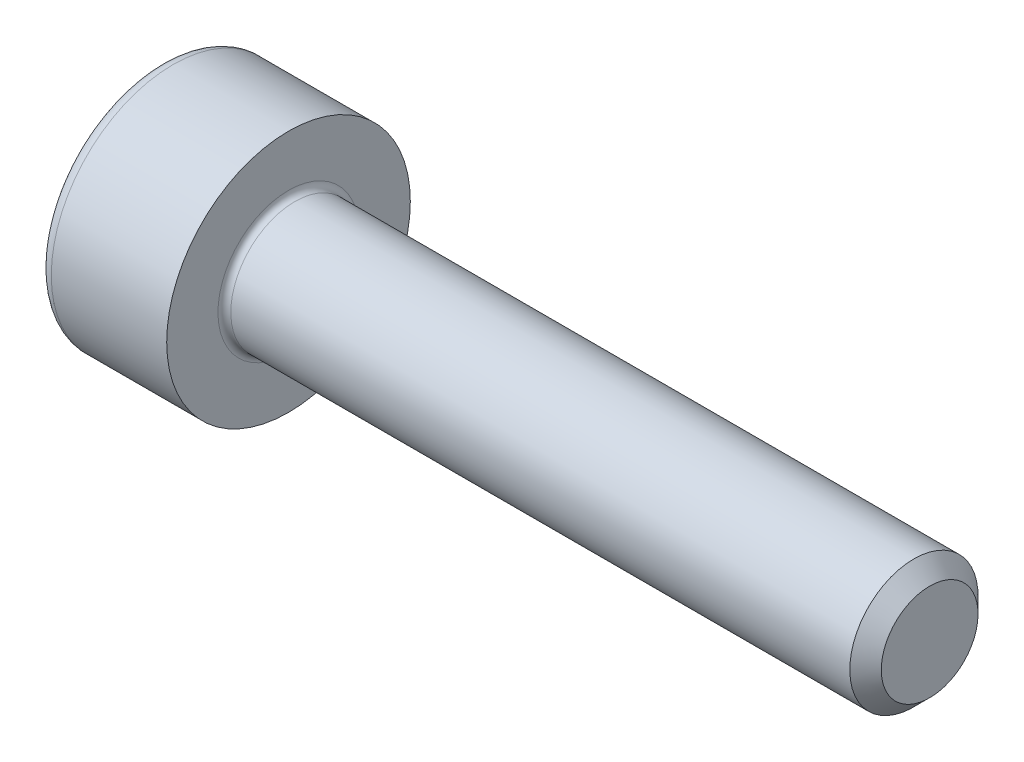
ISO-10303-21;
HEADER;
FILE_DESCRIPTION(('STEP AP214'),'2;1');
FILE_NAME('part.step','',(''),(''),'','','');
FILE_SCHEMA(('AUTOMOTIVE_DESIGN { 1 0 10303 214 1 1 1 1 }'));
ENDSEC;
DATA;
#1=APPLICATION_CONTEXT('core data for automotive mechanical design processes');
#2=APPLICATION_PROTOCOL_DEFINITION('international standard','automotive_design',2000,#1);
#3=PRODUCT_CONTEXT('',#1,'mechanical');
#4=PRODUCT('Part','Part','',(#3));
#5=PRODUCT_RELATED_PRODUCT_CATEGORY('part','',(#4));
#6=PRODUCT_DEFINITION_FORMATION('','',#4);
#7=PRODUCT_DEFINITION_CONTEXT('part definition',#1,'design');
#8=PRODUCT_DEFINITION('design','',#6,#7);
#9=PRODUCT_DEFINITION_SHAPE('','',#8);
#10=(LENGTH_UNIT() NAMED_UNIT(*) SI_UNIT(.MILLI.,.METRE.));
#11=(NAMED_UNIT(*) PLANE_ANGLE_UNIT() SI_UNIT($,.RADIAN.));
#12=(NAMED_UNIT(*) SI_UNIT($,.STERADIAN.) SOLID_ANGLE_UNIT());
#13=UNCERTAINTY_MEASURE_WITH_UNIT(LENGTH_MEASURE(1.E-05),#10,'distance_accuracy_value','');
#14=(GEOMETRIC_REPRESENTATION_CONTEXT(3) GLOBAL_UNCERTAINTY_ASSIGNED_CONTEXT((#13)) GLOBAL_UNIT_ASSIGNED_CONTEXT((#10,
#11,#12)) REPRESENTATION_CONTEXT('',''));
#15=CARTESIAN_POINT('',(0.,0.,0.));
#16=DIRECTION('',(0.,0.,1.));
#17=DIRECTION('',(1.,0.,0.));
#18=AXIS2_PLACEMENT_3D('',#15,#16,#17);
#19=CARTESIAN_POINT('',(0.100000000000002,0.,0.));
#20=DIRECTION('',(1.,0.,0.));
#21=DIRECTION('',(0.,1.,0.));
#22=AXIS2_PLACEMENT_3D('',#19,#20,#21);
#23=TOROIDAL_SURFACE('',#22,1.1,0.1);
#24=CARTESIAN_POINT('',(0.,0.,0.));
#25=DIRECTION('',(1.,0.,0.));
#26=DIRECTION('',(0.,1.,0.));
#27=AXIS2_PLACEMENT_3D('',#24,#25,#26);
#28=CIRCLE('',#27,1.1);
#29=CARTESIAN_POINT('',(0.,1.1,0.));
#30=VERTEX_POINT('',#29);
#31=EDGE_CURVE('E9',#30,#30,#28,.T.);
#32=ORIENTED_EDGE('',*,*,#31,.T.);
#33=EDGE_LOOP('',(#32));
#34=FACE_BOUND('',#33,.T.);
#35=CARTESIAN_POINT('',(0.100000000000002,0.,0.));
#36=DIRECTION('',(-1.,0.,0.));
#37=DIRECTION('',(0.,1.,0.));
#38=AXIS2_PLACEMENT_3D('',#35,#36,#37);
#39=CIRCLE('',#38,0.999999999999998);
#40=CARTESIAN_POINT('',(0.100000000000002,0.999999999999997,0.));
#41=VERTEX_POINT('',#40);
#42=EDGE_CURVE('E26',#41,#41,#39,.T.);
#43=ORIENTED_EDGE('',*,*,#42,.T.);
#44=EDGE_LOOP('',(#43));
#45=FACE_BOUND('',#44,.T.);
#46=ADVANCED_FACE('F15',(#34,#45),#23,.F.);
#47=CARTESIAN_POINT('',(5.52269,0.,0.));
#48=DIRECTION('',(1.,0.,0.));
#49=DIRECTION('',(0.,1.,0.));
#50=AXIS2_PLACEMENT_3D('',#47,#48,#49);
#51=CYLINDRICAL_SURFACE('',#50,0.999999999999998);
#52=CARTESIAN_POINT('',(9.75462,0.,0.));
#53=DIRECTION('',(1.,0.,0.));
#54=DIRECTION('',(0.,1.,0.));
#55=AXIS2_PLACEMENT_3D('',#52,#53,#54);
#56=CIRCLE('',#55,0.999999999999998);
#57=CARTESIAN_POINT('',(9.75462,0.999999999999998,0.));
#58=VERTEX_POINT('',#57);
#59=EDGE_CURVE('E160',#58,#58,#56,.T.);
#60=ORIENTED_EDGE('',*,*,#59,.F.);
#61=EDGE_LOOP('',(#60));
#62=FACE_BOUND('',#61,.T.);
#63=ORIENTED_EDGE('',*,*,#42,.F.);
#64=EDGE_LOOP('',(#63));
#65=FACE_BOUND('',#64,.T.);
#66=ADVANCED_FACE('F170',(#62,#65),#51,.T.);
#67=CARTESIAN_POINT('',(0.,1.45,0.));
#68=DIRECTION('',(1.,0.,0.));
#69=DIRECTION('',(0.,1.,0.));
#70=AXIS2_PLACEMENT_3D('',#67,#68,#69);
#71=PLANE('',#70);
#72=CARTESIAN_POINT('',(0.,0.,0.));
#73=DIRECTION('',(1.,0.,0.));
#74=DIRECTION('',(0.,1.,0.));
#75=AXIS2_PLACEMENT_3D('',#72,#73,#74);
#76=CIRCLE('',#75,1.9);
#77=CARTESIAN_POINT('',(0.,1.9,0.));
#78=VERTEX_POINT('',#77);
#79=EDGE_CURVE('E161',#78,#78,#76,.T.);
#80=ORIENTED_EDGE('',*,*,#79,.T.);
#81=EDGE_LOOP('',(#80));
#82=FACE_BOUND('',#81,.T.);
#83=ORIENTED_EDGE('',*,*,#31,.F.);
#84=EDGE_LOOP('',(#83));
#85=FACE_BOUND('',#84,.T.);
#86=ADVANCED_FACE('F172',(#82,#85),#71,.T.);
#87=CARTESIAN_POINT('',(9.87731,0.,0.));
#88=DIRECTION('',(-1.,0.,0.));
#89=DIRECTION('',(0.,1.,0.));
#90=AXIS2_PLACEMENT_3D('',#87,#88,#89);
#91=CONICAL_SURFACE('',#90,0.877309999999998,0.785398163397445);
#92=ORIENTED_EDGE('',*,*,#59,.T.);
#93=EDGE_LOOP('',(#92));
#94=FACE_BOUND('',#93,.T.);
#95=CARTESIAN_POINT('',(10.,0.,0.));
#96=DIRECTION('',(-1.,0.,0.));
#97=DIRECTION('',(0.,1.,0.));
#98=AXIS2_PLACEMENT_3D('',#95,#96,#97);
#99=CIRCLE('',#98,0.754619999999999);
#100=CARTESIAN_POINT('',(10.,0.754619999999999,0.));
#101=VERTEX_POINT('',#100);
#102=EDGE_CURVE('E157',#101,#101,#99,.T.);
#103=ORIENTED_EDGE('',*,*,#102,.T.);
#104=EDGE_LOOP('',(#103));
#105=FACE_BOUND('',#104,.T.);
#106=ADVANCED_FACE('F180',(#94,#105),#91,.T.);
#107=CARTESIAN_POINT('',(10.,0.499999999999999,0.));
#108=DIRECTION('',(1.,0.,0.));
#109=DIRECTION('',(0.,1.,0.));
#110=AXIS2_PLACEMENT_3D('',#107,#108,#109);
#111=PLANE('',#110);
#112=ORIENTED_EDGE('',*,*,#102,.F.);
#113=EDGE_LOOP('',(#112));
#114=FACE_BOUND('',#113,.T.);
#115=ADVANCED_FACE('F190',(#114),#111,.T.);
#116=CARTESIAN_POINT('',(-1.8,0.,0.));
#117=DIRECTION('',(1.,0.,0.));
#118=DIRECTION('',(0.,1.,0.));
#119=AXIS2_PLACEMENT_3D('',#116,#117,#118);
#120=TOROIDAL_SURFACE('',#119,1.7,0.2);
#121=CARTESIAN_POINT('',(-2.,0.,0.));
#122=DIRECTION('',(1.,0.,0.));
#123=DIRECTION('',(0.,1.,0.));
#124=AXIS2_PLACEMENT_3D('',#121,#122,#123);
#125=CIRCLE('',#124,1.7);
#126=CARTESIAN_POINT('',(-2.,1.7,0.));
#127=VERTEX_POINT('',#126);
#128=EDGE_CURVE('E154',#127,#127,#125,.T.);
#129=ORIENTED_EDGE('',*,*,#128,.T.);
#130=EDGE_LOOP('',(#129));
#131=FACE_BOUND('',#130,.T.);
#132=CARTESIAN_POINT('',(-1.8,0.,0.));
#133=DIRECTION('',(-1.,0.,0.));
#134=DIRECTION('',(0.,1.,0.));
#135=AXIS2_PLACEMENT_3D('',#132,#133,#134);
#136=CIRCLE('',#135,1.9);
#137=CARTESIAN_POINT('',(-1.8,1.9,0.));
#138=VERTEX_POINT('',#137);
#139=EDGE_CURVE('E151',#138,#138,#136,.T.);
#140=ORIENTED_EDGE('',*,*,#139,.T.);
#141=EDGE_LOOP('',(#140));
#142=FACE_BOUND('',#141,.T.);
#143=ADVANCED_FACE('F204',(#131,#142),#120,.T.);
#144=CARTESIAN_POINT('',(-2.,1.38301270189222,0.));
#145=DIRECTION('',(-1.,0.,0.));
#146=DIRECTION('',(0.,-1.,0.));
#147=AXIS2_PLACEMENT_3D('',#144,#145,#146);
#148=PLANE('',#147);
#149=DIRECTION('',(0.,0.,1.));
#150=VECTOR('',#149,1.);
#151=CARTESIAN_POINT('',(-2.,0.75,0.216506350946109));
#152=LINE('',#151,#150);
#153=CARTESIAN_POINT('',(-2.,0.749999999999999,-0.43301270189222));
#154=VERTEX_POINT('',#153);
#155=CARTESIAN_POINT('',(-2.,0.750000000000001,0.433012701892219));
#156=VERTEX_POINT('',#155);
#157=EDGE_CURVE('E149',#154,#156,#152,.T.);
#158=ORIENTED_EDGE('',*,*,#157,.T.);
#159=DIRECTION('',(0.,-0.866025403784438,0.500000000000001));
#160=VECTOR('',#159,1.);
#161=CARTESIAN_POINT('',(-2.,0.1875,0.757772228311384));
#162=LINE('',#161,#160);
#163=CARTESIAN_POINT('',(-2.,0.,0.866025403784439));
#164=VERTEX_POINT('',#163);
#165=EDGE_CURVE('E38',#156,#164,#162,.T.);
#166=ORIENTED_EDGE('',*,*,#165,.T.);
#167=DIRECTION('',(0.,-0.866025403784439,-0.5));
#168=VECTOR('',#167,1.);
#169=CARTESIAN_POINT('',(-2.,-0.5625,0.541265877365275));
#170=LINE('',#169,#168);
#171=CARTESIAN_POINT('',(-2.,-0.75,0.43301270189222));
#172=VERTEX_POINT('',#171);
#173=EDGE_CURVE('E94',#164,#172,#170,.T.);
#174=ORIENTED_EDGE('',*,*,#173,.T.);
#175=DIRECTION('',(0.,0.,-1.));
#176=VECTOR('',#175,1.);
#177=CARTESIAN_POINT('',(-2.,-0.75,-0.21650635094611));
#178=LINE('',#177,#176);
#179=CARTESIAN_POINT('',(-2.,-0.75,-0.433012701892219));
#180=VERTEX_POINT('',#179);
#181=EDGE_CURVE('E87',#172,#180,#178,.T.);
#182=ORIENTED_EDGE('',*,*,#181,.T.);
#183=DIRECTION('',(0.,0.866025403784438,-0.5));
#184=VECTOR('',#183,1.);
#185=CARTESIAN_POINT('',(-2.,-0.1875,-0.757772228311384));
#186=LINE('',#185,#184);
#187=CARTESIAN_POINT('',(-2.,0.,-0.866025403784439));
#188=VERTEX_POINT('',#187);
#189=EDGE_CURVE('E143',#180,#188,#186,.T.);
#190=ORIENTED_EDGE('',*,*,#189,.T.);
#191=DIRECTION('',(0.,0.866025403784439,0.5));
#192=VECTOR('',#191,1.);
#193=CARTESIAN_POINT('',(-2.,0.5625,-0.541265877365275));
#194=LINE('',#193,#192);
#195=EDGE_CURVE('E134',#188,#154,#194,.T.);
#196=ORIENTED_EDGE('',*,*,#195,.T.);
#197=EDGE_LOOP('',(#158,#166,#174,#182,#190,#196));
#198=FACE_BOUND('',#197,.T.);
#199=ORIENTED_EDGE('',*,*,#128,.F.);
#200=EDGE_LOOP('',(#199));
#201=FACE_BOUND('',#200,.T.);
#202=ADVANCED_FACE('F195',(#198,#201),#148,.T.);
#203=CARTESIAN_POINT('',(-0.999999999999997,0.,0.));
#204=DIRECTION('',(1.,0.,0.));
#205=DIRECTION('',(0.,1.,0.));
#206=AXIS2_PLACEMENT_3D('',#203,#204,#205);
#207=CYLINDRICAL_SURFACE('',#206,1.9);
#208=ORIENTED_EDGE('',*,*,#79,.F.);
#209=EDGE_LOOP('',(#208));
#210=FACE_BOUND('',#209,.T.);
#211=ORIENTED_EDGE('',*,*,#139,.F.);
#212=EDGE_LOOP('',(#211));
#213=FACE_BOUND('',#212,.T.);
#214=ADVANCED_FACE('F192',(#210,#213),#207,.T.);
#215=CARTESIAN_POINT('',(-2.,0.,-0.866025403784439));
#216=DIRECTION('',(0.,-0.5,-0.866025403784438));
#217=DIRECTION('',(0.,0.866025403784438,-0.5));
#218=AXIS2_PLACEMENT_3D('',#215,#216,#217);
#219=PLANE('',#218);
#220=CARTESIAN_POINT('',(-0.999999999999998,0.,-0.86602540378444));
#221=CARTESIAN_POINT('',(-0.874999999999996,-0.375,-0.649519052838329));
#222=CARTESIAN_POINT('',(-0.999999999999998,-0.750000000000003,-0.433012701892218));
#223=(BOUNDED_CURVE() B_SPLINE_CURVE(2,(#220,#221,#222),.UNSPECIFIED.,.F.,
.F.) B_SPLINE_CURVE_WITH_KNOTS((3,3),(0.,0.0876327103558444),
.UNSPECIFIED.) CURVE() GEOMETRIC_REPRESENTATION_ITEM() RATIONAL_B_SPLINE_CURVE((1.,
1.15470053837925,1.)) REPRESENTATION_ITEM(''));
#224=CARTESIAN_POINT('',(-0.999999999999997,0.,-0.866025403784439));
#225=VERTEX_POINT('',#224);
#226=CARTESIAN_POINT('',(-0.999999999999997,-0.750000000000001,-0.433012701892219));
#227=VERTEX_POINT('',#226);
#228=EDGE_CURVE('E78',#225,#227,#223,.T.);
#229=ORIENTED_EDGE('',*,*,#228,.F.);
#230=DIRECTION('',(-1.,0.,0.));
#231=VECTOR('',#230,1.);
#232=CARTESIAN_POINT('',(-1.5,0.,-0.866025403784439));
#233=LINE('',#232,#231);
#234=EDGE_CURVE('E124',#225,#188,#233,.T.);
#235=ORIENTED_EDGE('',*,*,#234,.T.);
#236=ORIENTED_EDGE('',*,*,#189,.F.);
#237=DIRECTION('',(-1.,0.,0.));
#238=VECTOR('',#237,1.);
#239=CARTESIAN_POINT('',(-1.5,-0.750000000000001,-0.433012701892219));
#240=LINE('',#239,#238);
#241=EDGE_CURVE('E90',#227,#180,#240,.T.);
#242=ORIENTED_EDGE('',*,*,#241,.F.);
#243=EDGE_LOOP('',(#229,#235,#236,#242));
#244=FACE_BOUND('',#243,.T.);
#245=ADVANCED_FACE('F194',(#244),#219,.F.);
#246=CARTESIAN_POINT('',(-2.,0.749999999999999,-0.43301270189222));
#247=DIRECTION('',(0.,0.5,-0.866025403784439));
#248=DIRECTION('',(0.,0.866025403784439,0.5));
#249=AXIS2_PLACEMENT_3D('',#246,#247,#248);
#250=PLANE('',#249);
#251=CARTESIAN_POINT('',(-0.999999999999998,0.750000000000002,-0.433012701892219));
#252=CARTESIAN_POINT('',(-0.874999999999997,0.375,-0.64951905283833));
#253=CARTESIAN_POINT('',(-0.999999999999998,0.,-0.86602540378444));
#254=(BOUNDED_CURVE() B_SPLINE_CURVE(2,(#251,#252,#253),.UNSPECIFIED.,.F.,
.F.) B_SPLINE_CURVE_WITH_KNOTS((3,3),(0.,0.0876327103558443),
.UNSPECIFIED.) CURVE() GEOMETRIC_REPRESENTATION_ITEM() RATIONAL_B_SPLINE_CURVE((1.,
1.15470053837925,1.)) REPRESENTATION_ITEM(''));
#255=CARTESIAN_POINT('',(-0.999999999999997,0.749999999999999,-0.433012701892221));
#256=VERTEX_POINT('',#255);
#257=EDGE_CURVE('E118',#256,#225,#254,.T.);
#258=ORIENTED_EDGE('',*,*,#257,.F.);
#259=DIRECTION('',(-1.,0.,0.));
#260=VECTOR('',#259,1.);
#261=CARTESIAN_POINT('',(-1.5,0.749999999999999,-0.433012701892221));
#262=LINE('',#261,#260);
#263=EDGE_CURVE('E113',#256,#154,#262,.T.);
#264=ORIENTED_EDGE('',*,*,#263,.T.);
#265=ORIENTED_EDGE('',*,*,#195,.F.);
#266=ORIENTED_EDGE('',*,*,#234,.F.);
#267=EDGE_LOOP('',(#258,#264,#265,#266));
#268=FACE_BOUND('',#267,.T.);
#269=ADVANCED_FACE('F201',(#268),#250,.F.);
#270=CARTESIAN_POINT('',(-2.,0.750000000000001,0.433012701892219));
#271=DIRECTION('',(0.,1.,0.));
#272=DIRECTION('',(0.,0.,1.));
#273=AXIS2_PLACEMENT_3D('',#270,#271,#272);
#274=PLANE('',#273);
#275=CARTESIAN_POINT('',(-0.999999999999998,0.750000000000001,0.433012701892221));
#276=CARTESIAN_POINT('',(-0.874999999999997,0.75,0.));
#277=CARTESIAN_POINT('',(-0.999999999999998,0.749999999999999,-0.433012701892223));
#278=(BOUNDED_CURVE() B_SPLINE_CURVE(2,(#275,#276,#277),.UNSPECIFIED.,.F.,
.F.) B_SPLINE_CURVE_WITH_KNOTS((3,3),(0.,0.0876327103558444),
.UNSPECIFIED.) CURVE() GEOMETRIC_REPRESENTATION_ITEM() RATIONAL_B_SPLINE_CURVE((1.,
1.15470053837925,1.)) REPRESENTATION_ITEM(''));
#279=CARTESIAN_POINT('',(-0.999999999999997,0.750000000000001,0.433012701892218));
#280=VERTEX_POINT('',#279);
#281=EDGE_CURVE('E97',#280,#256,#278,.T.);
#282=ORIENTED_EDGE('',*,*,#281,.F.);
#283=DIRECTION('',(-1.,0.,0.));
#284=VECTOR('',#283,1.);
#285=CARTESIAN_POINT('',(-1.5,0.750000000000001,0.433012701892218));
#286=LINE('',#285,#284);
#287=EDGE_CURVE('E107',#280,#156,#286,.T.);
#288=ORIENTED_EDGE('',*,*,#287,.T.);
#289=ORIENTED_EDGE('',*,*,#157,.F.);
#290=ORIENTED_EDGE('',*,*,#263,.F.);
#291=EDGE_LOOP('',(#282,#288,#289,#290));
#292=FACE_BOUND('',#291,.T.);
#293=ADVANCED_FACE('F222',(#292),#274,.F.);
#294=CARTESIAN_POINT('',(-2.,0.,0.866025403784439));
#295=DIRECTION('',(0.,0.500000000000001,0.866025403784438));
#296=DIRECTION('',(0.,-0.866025403784438,0.500000000000001));
#297=AXIS2_PLACEMENT_3D('',#294,#295,#296);
#298=PLANE('',#297);
#299=CARTESIAN_POINT('',(-0.999999999999998,0.,0.86602540378444));
#300=CARTESIAN_POINT('',(-0.874999999999996,0.375,0.649519052838329));
#301=CARTESIAN_POINT('',(-0.999999999999998,0.750000000000003,0.433012701892218));
#302=(BOUNDED_CURVE() B_SPLINE_CURVE(2,(#299,#300,#301),.UNSPECIFIED.,.F.,
.F.) B_SPLINE_CURVE_WITH_KNOTS((3,3),(0.,0.0876327103558444),
.UNSPECIFIED.) CURVE() GEOMETRIC_REPRESENTATION_ITEM() RATIONAL_B_SPLINE_CURVE((1.,
1.15470053837925,1.)) REPRESENTATION_ITEM(''));
#303=CARTESIAN_POINT('',(-0.999999999999997,0.,0.866025403784439));
#304=VERTEX_POINT('',#303);
#305=EDGE_CURVE('E95',#304,#280,#302,.T.);
#306=ORIENTED_EDGE('',*,*,#305,.F.);
#307=DIRECTION('',(1.,0.,0.));
#308=VECTOR('',#307,1.);
#309=CARTESIAN_POINT('',(-1.5,0.,0.866025403784439));
#310=LINE('',#309,#308);
#311=EDGE_CURVE('E91',#164,#304,#310,.T.);
#312=ORIENTED_EDGE('',*,*,#311,.F.);
#313=ORIENTED_EDGE('',*,*,#165,.F.);
#314=ORIENTED_EDGE('',*,*,#287,.F.);
#315=EDGE_LOOP('',(#306,#312,#313,#314));
#316=FACE_BOUND('',#315,.T.);
#317=ADVANCED_FACE('F226',(#316),#298,.F.);
#318=CARTESIAN_POINT('',(-2.,-0.75,-0.433012701892219));
#319=DIRECTION('',(0.,-1.,0.));
#320=DIRECTION('',(1.,0.,0.));
#321=AXIS2_PLACEMENT_3D('',#318,#319,#320);
#322=PLANE('',#321);
#323=CARTESIAN_POINT('',(-0.999999999999998,-0.75,-0.433012701892222));
#324=CARTESIAN_POINT('',(-0.874999999999997,-0.75,0.));
#325=CARTESIAN_POINT('',(-0.999999999999998,-0.75,0.433012701892222));
#326=(BOUNDED_CURVE() B_SPLINE_CURVE(2,(#323,#324,#325),.UNSPECIFIED.,.F.,
.F.) B_SPLINE_CURVE_WITH_KNOTS((3,3),(0.,0.0876327103558444),
.UNSPECIFIED.) CURVE() GEOMETRIC_REPRESENTATION_ITEM() RATIONAL_B_SPLINE_CURVE((1.,
1.15470053837925,1.)) REPRESENTATION_ITEM(''));
#327=CARTESIAN_POINT('',(-0.999999999999997,-0.75,0.43301270189222));
#328=VERTEX_POINT('',#327);
#329=EDGE_CURVE('E73',#227,#328,#326,.T.);
#330=ORIENTED_EDGE('',*,*,#329,.F.);
#331=ORIENTED_EDGE('',*,*,#241,.T.);
#332=ORIENTED_EDGE('',*,*,#181,.F.);
#333=DIRECTION('',(-1.,0.,0.));
#334=VECTOR('',#333,1.);
#335=CARTESIAN_POINT('',(-1.5,-0.75,0.43301270189222));
#336=LINE('',#335,#334);
#337=EDGE_CURVE('E84',#328,#172,#336,.T.);
#338=ORIENTED_EDGE('',*,*,#337,.F.);
#339=EDGE_LOOP('',(#330,#331,#332,#338));
#340=FACE_BOUND('',#339,.T.);
#341=ADVANCED_FACE('F85',(#340),#322,.F.);
#342=CARTESIAN_POINT('',(-2.,-0.75,0.43301270189222));
#343=DIRECTION('',(0.,-0.5,0.866025403784439));
#344=DIRECTION('',(0.,-0.866025403784439,-0.5));
#345=AXIS2_PLACEMENT_3D('',#342,#343,#344);
#346=PLANE('',#345);
#347=CARTESIAN_POINT('',(-0.999999999999998,-0.750000000000002,0.433012701892219));
#348=CARTESIAN_POINT('',(-0.874999999999997,-0.375,0.64951905283833));
#349=CARTESIAN_POINT('',(-0.999999999999998,0.,0.86602540378444));
#350=(BOUNDED_CURVE() B_SPLINE_CURVE(2,(#347,#348,#349),.UNSPECIFIED.,.F.,
.F.) B_SPLINE_CURVE_WITH_KNOTS((3,3),(0.,0.0876327103558443),
.UNSPECIFIED.) CURVE() GEOMETRIC_REPRESENTATION_ITEM() RATIONAL_B_SPLINE_CURVE((1.,
1.15470053837925,1.)) REPRESENTATION_ITEM(''));
#351=EDGE_CURVE('E19',#328,#304,#350,.T.);
#352=ORIENTED_EDGE('',*,*,#351,.F.);
#353=ORIENTED_EDGE('',*,*,#337,.T.);
#354=ORIENTED_EDGE('',*,*,#173,.F.);
#355=ORIENTED_EDGE('',*,*,#311,.T.);
#356=EDGE_LOOP('',(#352,#353,#354,#355));
#357=FACE_BOUND('',#356,.T.);
#358=ADVANCED_FACE('F93',(#357),#346,.F.);
#359=CARTESIAN_POINT('',(-0.749999999999997,0.,0.));
#360=DIRECTION('',(-1.,0.,0.));
#361=DIRECTION('',(0.,1.,0.));
#362=AXIS2_PLACEMENT_3D('',#359,#360,#361);
#363=CONICAL_SURFACE('',#362,0.43301270189222,1.0471975511966);
#364=CARTESIAN_POINT('',(-0.499999999999998,0.,0.));
#365=VERTEX_POINT('',#364);
#366=VERTEX_LOOP('',#365);
#367=FACE_BOUND('',#366,.T.);
#368=ORIENTED_EDGE('',*,*,#305,.T.);
#369=ORIENTED_EDGE('',*,*,#281,.T.);
#370=ORIENTED_EDGE('',*,*,#257,.T.);
#371=ORIENTED_EDGE('',*,*,#228,.T.);
#372=ORIENTED_EDGE('',*,*,#329,.T.);
#373=ORIENTED_EDGE('',*,*,#351,.T.);
#374=EDGE_LOOP('',(#368,#369,#370,#371,#372,#373));
#375=FACE_BOUND('',#374,.T.);
#376=ADVANCED_FACE('F17',(#367,#375),#363,.F.);
#377=CLOSED_SHELL('',(#46,#66,#86,#106,#115,#143,#202,#214,#245,#269,#293,#317,#341,#358,#376));
#378=MANIFOLD_SOLID_BREP('B1',#377);
#379=ADVANCED_BREP_SHAPE_REPRESENTATION('',(#18,#378),#14);
#380=SHAPE_DEFINITION_REPRESENTATION(#9,#379);
ENDSEC;
END-ISO-10303-21;
